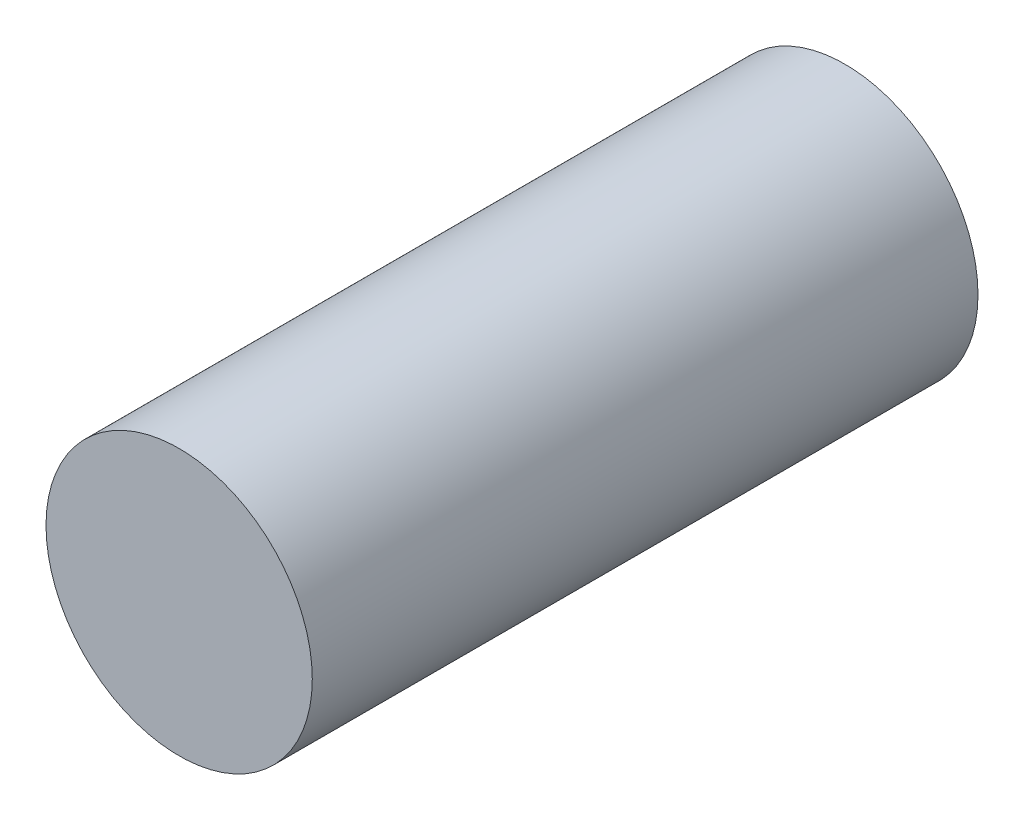
ISO-10303-21;
HEADER;
FILE_DESCRIPTION(('STEP AP214'),'2;1');
FILE_NAME('part.step','',(''),(''),'','','');
FILE_SCHEMA(('AUTOMOTIVE_DESIGN { 1 0 10303 214 1 1 1 1 }'));
ENDSEC;
DATA;
#1=APPLICATION_CONTEXT('core data for automotive mechanical design processes');
#2=APPLICATION_PROTOCOL_DEFINITION('international standard','automotive_design',2000,#1);
#3=PRODUCT_CONTEXT('',#1,'mechanical');
#4=PRODUCT('Part','Part','',(#3));
#5=PRODUCT_RELATED_PRODUCT_CATEGORY('part','',(#4));
#6=PRODUCT_DEFINITION_FORMATION('','',#4);
#7=PRODUCT_DEFINITION_CONTEXT('part definition',#1,'design');
#8=PRODUCT_DEFINITION('design','',#6,#7);
#9=PRODUCT_DEFINITION_SHAPE('','',#8);
#10=(LENGTH_UNIT() NAMED_UNIT(*) SI_UNIT(.MILLI.,.METRE.));
#11=(NAMED_UNIT(*) PLANE_ANGLE_UNIT() SI_UNIT($,.RADIAN.));
#12=(NAMED_UNIT(*) SI_UNIT($,.STERADIAN.) SOLID_ANGLE_UNIT());
#13=UNCERTAINTY_MEASURE_WITH_UNIT(LENGTH_MEASURE(1.E-05),#10,'distance_accuracy_value','');
#14=(GEOMETRIC_REPRESENTATION_CONTEXT(3) GLOBAL_UNCERTAINTY_ASSIGNED_CONTEXT((#13)) GLOBAL_UNIT_ASSIGNED_CONTEXT((#10,
#11,#12)) REPRESENTATION_CONTEXT('',''));
#15=CARTESIAN_POINT('',(0.,0.,0.));
#16=DIRECTION('',(0.,0.,1.));
#17=DIRECTION('',(1.,0.,0.));
#18=AXIS2_PLACEMENT_3D('',#15,#16,#17);
#19=CARTESIAN_POINT('',(-5.39999999999999,0.,-2.5));
#20=DIRECTION('',(0.,0.,-1.));
#21=DIRECTION('',(-1.,0.,0.));
#22=AXIS2_PLACEMENT_3D('',#19,#20,#21);
#23=PLANE('',#22);
#24=CARTESIAN_POINT('',(-5.4,0.,-2.5));
#25=DIRECTION('',(0.,0.,-1.));
#26=DIRECTION('',(-1.,0.,0.));
#27=AXIS2_PLACEMENT_3D('',#24,#25,#26);
#28=CIRCLE('',#27,0.599999999999999);
#29=CARTESIAN_POINT('',(-6.,0.,-2.5));
#30=VERTEX_POINT('',#29);
#31=EDGE_CURVE('E17',#30,#30,#28,.F.);
#32=ORIENTED_EDGE('',*,*,#31,.F.);
#33=EDGE_LOOP('',(#32));
#34=FACE_BOUND('',#33,.T.);
#35=ADVANCED_FACE('F14',(#34),#23,.T.);
#36=CARTESIAN_POINT('',(-5.4,0.,0.499999999999999));
#37=DIRECTION('',(0.,0.,-1.));
#38=DIRECTION('',(-1.,0.,0.));
#39=AXIS2_PLACEMENT_3D('',#36,#37,#38);
#40=PLANE('',#39);
#41=CARTESIAN_POINT('',(-5.4,0.,0.499999999999999));
#42=DIRECTION('',(0.,0.,-1.));
#43=DIRECTION('',(-1.,0.,0.));
#44=AXIS2_PLACEMENT_3D('',#41,#42,#43);
#45=CIRCLE('',#44,0.599999999999999);
#46=CARTESIAN_POINT('',(-6.,0.,0.499999999999999));
#47=VERTEX_POINT('',#46);
#48=EDGE_CURVE('E10',#47,#47,#45,.T.);
#49=ORIENTED_EDGE('',*,*,#48,.F.);
#50=EDGE_LOOP('',(#49));
#51=FACE_BOUND('',#50,.T.);
#52=ADVANCED_FACE('F32',(#51),#40,.F.);
#53=CARTESIAN_POINT('',(-5.4,0.,0.499999999999999));
#54=DIRECTION('',(0.,0.,-1.));
#55=DIRECTION('',(-1.,0.,0.));
#56=AXIS2_PLACEMENT_3D('',#53,#54,#55);
#57=CYLINDRICAL_SURFACE('',#56,0.599999999999999);
#58=ORIENTED_EDGE('',*,*,#48,.T.);
#59=EDGE_LOOP('',(#58));
#60=FACE_BOUND('',#59,.T.);
#61=ORIENTED_EDGE('',*,*,#31,.T.);
#62=EDGE_LOOP('',(#61));
#63=FACE_BOUND('',#62,.T.);
#64=ADVANCED_FACE('F29',(#60,#63),#57,.T.);
#65=CLOSED_SHELL('',(#35,#52,#64));
#66=MANIFOLD_SOLID_BREP('B1',#65);
#67=ADVANCED_BREP_SHAPE_REPRESENTATION('',(#18,#66),#14);
#68=SHAPE_DEFINITION_REPRESENTATION(#9,#67);
ENDSEC;
END-ISO-10303-21;
